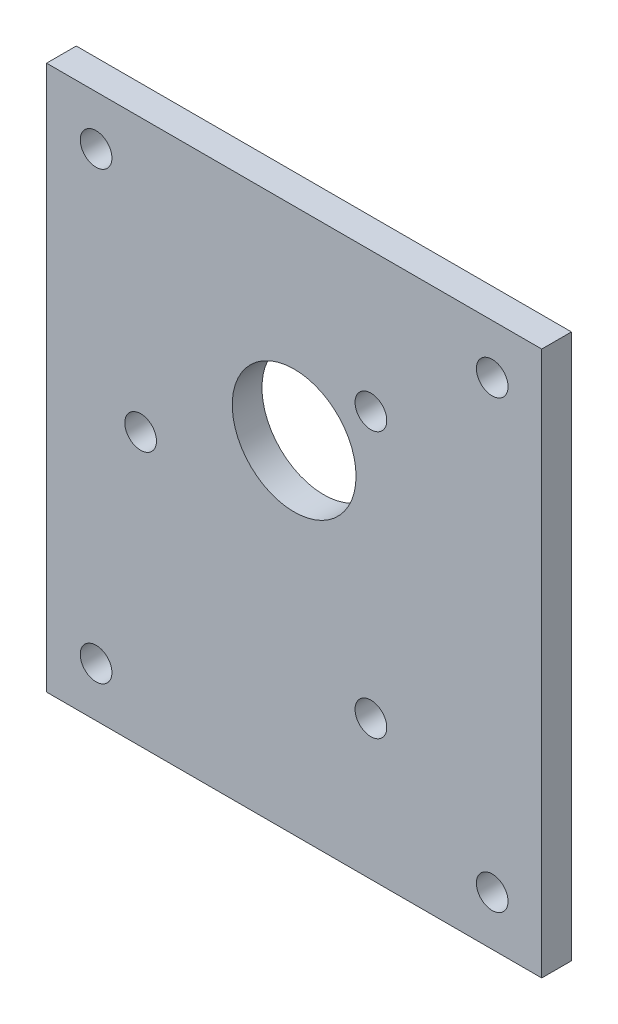
ISO-10303-21;
HEADER;
FILE_DESCRIPTION(('STEP AP214'),'2;1');
FILE_NAME('part.step','',(''),(''),'','','');
FILE_SCHEMA(('AUTOMOTIVE_DESIGN { 1 0 10303 214 1 1 1 1 }'));
ENDSEC;
DATA;
#1=APPLICATION_CONTEXT('core data for automotive mechanical design processes');
#2=APPLICATION_PROTOCOL_DEFINITION('international standard','automotive_design',2000,#1);
#3=PRODUCT_CONTEXT('',#1,'mechanical');
#4=PRODUCT('Part','Part','',(#3));
#5=PRODUCT_RELATED_PRODUCT_CATEGORY('part','',(#4));
#6=PRODUCT_DEFINITION_FORMATION('','',#4);
#7=PRODUCT_DEFINITION_CONTEXT('part definition',#1,'design');
#8=PRODUCT_DEFINITION('design','',#6,#7);
#9=PRODUCT_DEFINITION_SHAPE('','',#8);
#10=(LENGTH_UNIT() NAMED_UNIT(*) SI_UNIT(.MILLI.,.METRE.));
#11=(NAMED_UNIT(*) PLANE_ANGLE_UNIT() SI_UNIT($,.RADIAN.));
#12=(NAMED_UNIT(*) SI_UNIT($,.STERADIAN.) SOLID_ANGLE_UNIT());
#13=UNCERTAINTY_MEASURE_WITH_UNIT(LENGTH_MEASURE(1.E-05),#10,'distance_accuracy_value','');
#14=(GEOMETRIC_REPRESENTATION_CONTEXT(3) GLOBAL_UNCERTAINTY_ASSIGNED_CONTEXT((#13)) GLOBAL_UNIT_ASSIGNED_CONTEXT((#10,
#11,#12)) REPRESENTATION_CONTEXT('',''));
#15=CARTESIAN_POINT('',(0.,0.,0.));
#16=DIRECTION('',(0.,0.,1.));
#17=DIRECTION('',(1.,0.,0.));
#18=AXIS2_PLACEMENT_3D('',#15,#16,#17);
#19=CARTESIAN_POINT('',(0.,0.,3.));
#20=DIRECTION('',(0.,0.,1.));
#21=DIRECTION('',(1.,0.,0.));
#22=AXIS2_PLACEMENT_3D('',#19,#20,#21);
#23=PLANE('',#22);
#24=CARTESIAN_POINT('',(-20.,-22.5,3.));
#25=DIRECTION('',(0.,0.,1.));
#26=DIRECTION('',(1.,0.,0.));
#27=AXIS2_PLACEMENT_3D('',#24,#25,#26);
#28=CIRCLE('',#27,1.6);
#29=CARTESIAN_POINT('',(-18.4,-22.5,3.));
#30=VERTEX_POINT('',#29);
#31=EDGE_CURVE('E178',#30,#30,#28,.T.);
#32=ORIENTED_EDGE('',*,*,#31,.F.);
#33=EDGE_LOOP('',(#32));
#34=FACE_BOUND('',#33,.T.);
#35=CARTESIAN_POINT('',(-20.,22.5,3.));
#36=DIRECTION('',(0.,0.,1.));
#37=DIRECTION('',(1.,0.,0.));
#38=AXIS2_PLACEMENT_3D('',#35,#36,#37);
#39=CIRCLE('',#38,1.6);
#40=CARTESIAN_POINT('',(-18.4,22.5,3.));
#41=VERTEX_POINT('',#40);
#42=EDGE_CURVE('E162',#41,#41,#39,.T.);
#43=ORIENTED_EDGE('',*,*,#42,.F.);
#44=EDGE_LOOP('',(#43));
#45=FACE_BOUND('',#44,.T.);
#46=CARTESIAN_POINT('',(7.75000000000006,13.4233937586588,3.));
#47=DIRECTION('',(0.,0.,1.));
#48=DIRECTION('',(1.,0.,0.));
#49=AXIS2_PLACEMENT_3D('',#46,#47,#48);
#50=CIRCLE('',#49,1.6);
#51=CARTESIAN_POINT('',(9.35000000000006,13.4233937586588,3.));
#52=VERTEX_POINT('',#51);
#53=EDGE_CURVE('E146',#52,#52,#50,.T.);
#54=ORIENTED_EDGE('',*,*,#53,.F.);
#55=EDGE_LOOP('',(#54));
#56=FACE_BOUND('',#55,.T.);
#57=CARTESIAN_POINT('',(0.,7.,3.));
#58=DIRECTION('',(0.,0.,1.));
#59=DIRECTION('',(1.,0.,0.));
#60=AXIS2_PLACEMENT_3D('',#57,#58,#59);
#61=CIRCLE('',#60,6.25000000000001);
#62=CARTESIAN_POINT('',(6.25000000000001,7.,3.));
#63=VERTEX_POINT('',#62);
#64=EDGE_CURVE('E116',#63,#63,#61,.T.);
#65=ORIENTED_EDGE('',*,*,#64,.F.);
#66=EDGE_LOOP('',(#65));
#67=FACE_BOUND('',#66,.T.);
#68=DIRECTION('',(0.,1.,0.));
#69=VECTOR('',#68,1.);
#70=CARTESIAN_POINT('',(25.,27.5,3.));
#71=LINE('',#70,#69);
#72=CARTESIAN_POINT('',(25.,-27.5,3.));
#73=VERTEX_POINT('',#72);
#74=CARTESIAN_POINT('',(25.,27.5,3.));
#75=VERTEX_POINT('',#74);
#76=EDGE_CURVE('E96',#73,#75,#71,.T.);
#77=ORIENTED_EDGE('',*,*,#76,.T.);
#78=DIRECTION('',(-1.,0.,0.));
#79=VECTOR('',#78,1.);
#80=CARTESIAN_POINT('',(-25.,27.5,3.));
#81=LINE('',#80,#79);
#82=CARTESIAN_POINT('',(-25.,27.5,3.));
#83=VERTEX_POINT('',#82);
#84=EDGE_CURVE('E91',#75,#83,#81,.T.);
#85=ORIENTED_EDGE('',*,*,#84,.T.);
#86=DIRECTION('',(0.,-1.,0.));
#87=VECTOR('',#86,1.);
#88=CARTESIAN_POINT('',(-25.,27.5,3.));
#89=LINE('',#88,#87);
#90=CARTESIAN_POINT('',(-25.,-27.5,3.));
#91=VERTEX_POINT('',#90);
#92=EDGE_CURVE('E94',#83,#91,#89,.T.);
#93=ORIENTED_EDGE('',*,*,#92,.T.);
#94=DIRECTION('',(1.,0.,0.));
#95=VECTOR('',#94,1.);
#96=CARTESIAN_POINT('',(-25.,-27.5,3.));
#97=LINE('',#96,#95);
#98=EDGE_CURVE('E61',#91,#73,#97,.T.);
#99=ORIENTED_EDGE('',*,*,#98,.T.);
#100=EDGE_LOOP('',(#77,#85,#93,#99));
#101=FACE_BOUND('',#100,.T.);
#102=CARTESIAN_POINT('',(-15.5,0.,3.));
#103=DIRECTION('',(0.,0.,1.));
#104=DIRECTION('',(1.,0.,0.));
#105=AXIS2_PLACEMENT_3D('',#102,#103,#104);
#106=CIRCLE('',#105,1.6);
#107=CARTESIAN_POINT('',(-13.9,0.,3.));
#108=VERTEX_POINT('',#107);
#109=EDGE_CURVE('E138',#108,#108,#106,.T.);
#110=ORIENTED_EDGE('',*,*,#109,.F.);
#111=EDGE_LOOP('',(#110));
#112=FACE_BOUND('',#111,.T.);
#113=CARTESIAN_POINT('',(7.74999999999987,-13.4233937586589,3.));
#114=DIRECTION('',(0.,0.,1.));
#115=DIRECTION('',(1.,0.,0.));
#116=AXIS2_PLACEMENT_3D('',#113,#114,#115);
#117=CIRCLE('',#116,1.6);
#118=CARTESIAN_POINT('',(9.34999999999988,-13.4233937586589,3.));
#119=VERTEX_POINT('',#118);
#120=EDGE_CURVE('E154',#119,#119,#117,.T.);
#121=ORIENTED_EDGE('',*,*,#120,.F.);
#122=EDGE_LOOP('',(#121));
#123=FACE_BOUND('',#122,.T.);
#124=CARTESIAN_POINT('',(20.,22.5,3.));
#125=DIRECTION('',(0.,0.,1.));
#126=DIRECTION('',(1.,0.,0.));
#127=AXIS2_PLACEMENT_3D('',#124,#125,#126);
#128=CIRCLE('',#127,1.6);
#129=CARTESIAN_POINT('',(21.6,22.5,3.));
#130=VERTEX_POINT('',#129);
#131=EDGE_CURVE('E170',#130,#130,#128,.T.);
#132=ORIENTED_EDGE('',*,*,#131,.F.);
#133=EDGE_LOOP('',(#132));
#134=FACE_BOUND('',#133,.T.);
#135=CARTESIAN_POINT('',(20.,-22.5,3.));
#136=DIRECTION('',(0.,0.,1.));
#137=DIRECTION('',(1.,0.,0.));
#138=AXIS2_PLACEMENT_3D('',#135,#136,#137);
#139=CIRCLE('',#138,1.6);
#140=CARTESIAN_POINT('',(21.6,-22.5,3.));
#141=VERTEX_POINT('',#140);
#142=EDGE_CURVE('E186',#141,#141,#139,.T.);
#143=ORIENTED_EDGE('',*,*,#142,.F.);
#144=EDGE_LOOP('',(#143));
#145=FACE_BOUND('',#144,.T.);
#146=ADVANCED_FACE('F43',(#34,#45,#56,#67,#101,#112,#123,#134,#145),#23,.T.);
#147=CARTESIAN_POINT('',(0.,0.,0.));
#148=DIRECTION('',(0.,0.,1.));
#149=DIRECTION('',(1.,0.,0.));
#150=AXIS2_PLACEMENT_3D('',#147,#148,#149);
#151=PLANE('',#150);
#152=DIRECTION('',(0.,1.,0.));
#153=VECTOR('',#152,1.);
#154=CARTESIAN_POINT('',(25.,27.5,0.));
#155=LINE('',#154,#153);
#156=CARTESIAN_POINT('',(25.,-27.5,0.));
#157=VERTEX_POINT('',#156);
#158=CARTESIAN_POINT('',(25.,27.5,0.));
#159=VERTEX_POINT('',#158);
#160=EDGE_CURVE('E112',#157,#159,#155,.T.);
#161=ORIENTED_EDGE('',*,*,#160,.F.);
#162=DIRECTION('',(1.,0.,0.));
#163=VECTOR('',#162,1.);
#164=CARTESIAN_POINT('',(-25.,-27.5,0.));
#165=LINE('',#164,#163);
#166=CARTESIAN_POINT('',(-25.,-27.5,0.));
#167=VERTEX_POINT('',#166);
#168=EDGE_CURVE('E84',#167,#157,#165,.T.);
#169=ORIENTED_EDGE('',*,*,#168,.F.);
#170=DIRECTION('',(0.,-1.,0.));
#171=VECTOR('',#170,1.);
#172=CARTESIAN_POINT('',(-25.,27.5,0.));
#173=LINE('',#172,#171);
#174=CARTESIAN_POINT('',(-25.,27.5,0.));
#175=VERTEX_POINT('',#174);
#176=EDGE_CURVE('E78',#175,#167,#173,.T.);
#177=ORIENTED_EDGE('',*,*,#176,.F.);
#178=DIRECTION('',(-1.,0.,0.));
#179=VECTOR('',#178,1.);
#180=CARTESIAN_POINT('',(-25.,27.5,0.));
#181=LINE('',#180,#179);
#182=EDGE_CURVE('E101',#159,#175,#181,.T.);
#183=ORIENTED_EDGE('',*,*,#182,.F.);
#184=EDGE_LOOP('',(#161,#169,#177,#183));
#185=FACE_BOUND('',#184,.T.);
#186=CARTESIAN_POINT('',(0.,7.,0.));
#187=DIRECTION('',(0.,0.,1.));
#188=DIRECTION('',(1.,0.,0.));
#189=AXIS2_PLACEMENT_3D('',#186,#187,#188);
#190=CIRCLE('',#189,6.25000000000001);
#191=CARTESIAN_POINT('',(6.25000000000001,7.,0.));
#192=VERTEX_POINT('',#191);
#193=EDGE_CURVE('E134',#192,#192,#190,.T.);
#194=ORIENTED_EDGE('',*,*,#193,.T.);
#195=EDGE_LOOP('',(#194));
#196=FACE_BOUND('',#195,.T.);
#197=CARTESIAN_POINT('',(-15.5,0.,0.));
#198=DIRECTION('',(0.,0.,1.));
#199=DIRECTION('',(1.,0.,0.));
#200=AXIS2_PLACEMENT_3D('',#197,#198,#199);
#201=CIRCLE('',#200,1.6);
#202=CARTESIAN_POINT('',(-13.9,0.,0.));
#203=VERTEX_POINT('',#202);
#204=EDGE_CURVE('E142',#203,#203,#201,.T.);
#205=ORIENTED_EDGE('',*,*,#204,.T.);
#206=EDGE_LOOP('',(#205));
#207=FACE_BOUND('',#206,.T.);
#208=CARTESIAN_POINT('',(7.75000000000006,13.4233937586588,0.));
#209=DIRECTION('',(0.,0.,1.));
#210=DIRECTION('',(1.,0.,0.));
#211=AXIS2_PLACEMENT_3D('',#208,#209,#210);
#212=CIRCLE('',#211,1.6);
#213=CARTESIAN_POINT('',(9.35000000000006,13.4233937586588,0.));
#214=VERTEX_POINT('',#213);
#215=EDGE_CURVE('E150',#214,#214,#212,.T.);
#216=ORIENTED_EDGE('',*,*,#215,.T.);
#217=EDGE_LOOP('',(#216));
#218=FACE_BOUND('',#217,.T.);
#219=CARTESIAN_POINT('',(7.74999999999987,-13.4233937586589,0.));
#220=DIRECTION('',(0.,0.,1.));
#221=DIRECTION('',(1.,0.,0.));
#222=AXIS2_PLACEMENT_3D('',#219,#220,#221);
#223=CIRCLE('',#222,1.6);
#224=CARTESIAN_POINT('',(9.34999999999988,-13.4233937586589,0.));
#225=VERTEX_POINT('',#224);
#226=EDGE_CURVE('E158',#225,#225,#223,.T.);
#227=ORIENTED_EDGE('',*,*,#226,.T.);
#228=EDGE_LOOP('',(#227));
#229=FACE_BOUND('',#228,.T.);
#230=CARTESIAN_POINT('',(-20.,22.5,0.));
#231=DIRECTION('',(0.,0.,1.));
#232=DIRECTION('',(1.,0.,0.));
#233=AXIS2_PLACEMENT_3D('',#230,#231,#232);
#234=CIRCLE('',#233,1.6);
#235=CARTESIAN_POINT('',(-18.4,22.5,0.));
#236=VERTEX_POINT('',#235);
#237=EDGE_CURVE('E166',#236,#236,#234,.T.);
#238=ORIENTED_EDGE('',*,*,#237,.T.);
#239=EDGE_LOOP('',(#238));
#240=FACE_BOUND('',#239,.T.);
#241=CARTESIAN_POINT('',(20.,22.5,0.));
#242=DIRECTION('',(0.,0.,1.));
#243=DIRECTION('',(1.,0.,0.));
#244=AXIS2_PLACEMENT_3D('',#241,#242,#243);
#245=CIRCLE('',#244,1.6);
#246=CARTESIAN_POINT('',(21.6,22.5,0.));
#247=VERTEX_POINT('',#246);
#248=EDGE_CURVE('E174',#247,#247,#245,.T.);
#249=ORIENTED_EDGE('',*,*,#248,.T.);
#250=EDGE_LOOP('',(#249));
#251=FACE_BOUND('',#250,.T.);
#252=CARTESIAN_POINT('',(-20.,-22.5,0.));
#253=DIRECTION('',(0.,0.,1.));
#254=DIRECTION('',(1.,0.,0.));
#255=AXIS2_PLACEMENT_3D('',#252,#253,#254);
#256=CIRCLE('',#255,1.6);
#257=CARTESIAN_POINT('',(-18.4,-22.5,0.));
#258=VERTEX_POINT('',#257);
#259=EDGE_CURVE('E182',#258,#258,#256,.T.);
#260=ORIENTED_EDGE('',*,*,#259,.T.);
#261=EDGE_LOOP('',(#260));
#262=FACE_BOUND('',#261,.T.);
#263=CARTESIAN_POINT('',(20.,-22.5,0.));
#264=DIRECTION('',(0.,0.,1.));
#265=DIRECTION('',(1.,0.,0.));
#266=AXIS2_PLACEMENT_3D('',#263,#264,#265);
#267=CIRCLE('',#266,1.6);
#268=CARTESIAN_POINT('',(21.6,-22.5,0.));
#269=VERTEX_POINT('',#268);
#270=EDGE_CURVE('E190',#269,#269,#267,.T.);
#271=ORIENTED_EDGE('',*,*,#270,.T.);
#272=EDGE_LOOP('',(#271));
#273=FACE_BOUND('',#272,.T.);
#274=ADVANCED_FACE('F129',(#185,#196,#207,#218,#229,#240,#251,#262,#273),#151,.F.);
#275=CARTESIAN_POINT('',(25.,27.5,3.));
#276=DIRECTION('',(-1.,0.,0.));
#277=DIRECTION('',(0.,-1.,0.));
#278=AXIS2_PLACEMENT_3D('',#275,#276,#277);
#279=PLANE('',#278);
#280=ORIENTED_EDGE('',*,*,#160,.T.);
#281=DIRECTION('',(0.,0.,-1.));
#282=VECTOR('',#281,1.);
#283=CARTESIAN_POINT('',(25.,27.5,3.));
#284=LINE('',#283,#282);
#285=EDGE_CURVE('E11',#75,#159,#284,.T.);
#286=ORIENTED_EDGE('',*,*,#285,.F.);
#287=ORIENTED_EDGE('',*,*,#76,.F.);
#288=DIRECTION('',(0.,0.,-1.));
#289=VECTOR('',#288,1.);
#290=CARTESIAN_POINT('',(25.,-27.5,3.));
#291=LINE('',#290,#289);
#292=EDGE_CURVE('E108',#73,#157,#291,.T.);
#293=ORIENTED_EDGE('',*,*,#292,.T.);
#294=EDGE_LOOP('',(#280,#286,#287,#293));
#295=FACE_BOUND('',#294,.T.);
#296=ADVANCED_FACE('F45',(#295),#279,.F.);
#297=CARTESIAN_POINT('',(-25.,27.5,3.));
#298=DIRECTION('',(0.,-1.,0.));
#299=DIRECTION('',(0.,0.,-1.));
#300=AXIS2_PLACEMENT_3D('',#297,#298,#299);
#301=PLANE('',#300);
#302=ORIENTED_EDGE('',*,*,#182,.T.);
#303=DIRECTION('',(0.,0.,-1.));
#304=VECTOR('',#303,1.);
#305=CARTESIAN_POINT('',(-25.,27.5,3.));
#306=LINE('',#305,#304);
#307=EDGE_CURVE('E53',#83,#175,#306,.T.);
#308=ORIENTED_EDGE('',*,*,#307,.F.);
#309=ORIENTED_EDGE('',*,*,#84,.F.);
#310=ORIENTED_EDGE('',*,*,#285,.T.);
#311=EDGE_LOOP('',(#302,#308,#309,#310));
#312=FACE_BOUND('',#311,.T.);
#313=ADVANCED_FACE('F100',(#312),#301,.F.);
#314=CARTESIAN_POINT('',(-25.,27.5,3.));
#315=DIRECTION('',(1.,0.,0.));
#316=DIRECTION('',(0.,1.,0.));
#317=AXIS2_PLACEMENT_3D('',#314,#315,#316);
#318=PLANE('',#317);
#319=ORIENTED_EDGE('',*,*,#176,.T.);
#320=DIRECTION('',(0.,0.,-1.));
#321=VECTOR('',#320,1.);
#322=CARTESIAN_POINT('',(-25.,-27.5,3.));
#323=LINE('',#322,#321);
#324=EDGE_CURVE('E103',#91,#167,#323,.T.);
#325=ORIENTED_EDGE('',*,*,#324,.F.);
#326=ORIENTED_EDGE('',*,*,#92,.F.);
#327=ORIENTED_EDGE('',*,*,#307,.T.);
#328=EDGE_LOOP('',(#319,#325,#326,#327));
#329=FACE_BOUND('',#328,.T.);
#330=ADVANCED_FACE('F104',(#329),#318,.F.);
#331=CARTESIAN_POINT('',(-25.,-27.5,3.));
#332=DIRECTION('',(0.,1.,0.));
#333=DIRECTION('',(0.,0.,1.));
#334=AXIS2_PLACEMENT_3D('',#331,#332,#333);
#335=PLANE('',#334);
#336=ORIENTED_EDGE('',*,*,#168,.T.);
#337=ORIENTED_EDGE('',*,*,#292,.F.);
#338=ORIENTED_EDGE('',*,*,#98,.F.);
#339=ORIENTED_EDGE('',*,*,#324,.T.);
#340=EDGE_LOOP('',(#336,#337,#338,#339));
#341=FACE_BOUND('',#340,.T.);
#342=ADVANCED_FACE('F126',(#341),#335,.F.);
#343=CARTESIAN_POINT('',(0.,7.,3.));
#344=DIRECTION('',(0.,0.,-1.));
#345=DIRECTION('',(-1.,0.,0.));
#346=AXIS2_PLACEMENT_3D('',#343,#344,#345);
#347=CYLINDRICAL_SURFACE('',#346,6.25000000000001);
#348=ORIENTED_EDGE('',*,*,#64,.T.);
#349=EDGE_LOOP('',(#348));
#350=FACE_BOUND('',#349,.T.);
#351=ORIENTED_EDGE('',*,*,#193,.F.);
#352=EDGE_LOOP('',(#351));
#353=FACE_BOUND('',#352,.T.);
#354=ADVANCED_FACE('F211',(#350,#353),#347,.F.);
#355=CARTESIAN_POINT('',(-15.5,0.,3.));
#356=DIRECTION('',(0.,0.,-1.));
#357=DIRECTION('',(-1.,0.,0.));
#358=AXIS2_PLACEMENT_3D('',#355,#356,#357);
#359=CYLINDRICAL_SURFACE('',#358,1.6);
#360=ORIENTED_EDGE('',*,*,#109,.T.);
#361=EDGE_LOOP('',(#360));
#362=FACE_BOUND('',#361,.T.);
#363=ORIENTED_EDGE('',*,*,#204,.F.);
#364=EDGE_LOOP('',(#363));
#365=FACE_BOUND('',#364,.T.);
#366=ADVANCED_FACE('F265',(#362,#365),#359,.F.);
#367=CARTESIAN_POINT('',(7.75000000000006,13.4233937586588,3.));
#368=DIRECTION('',(0.,0.,-1.));
#369=DIRECTION('',(-1.,0.,0.));
#370=AXIS2_PLACEMENT_3D('',#367,#368,#369);
#371=CYLINDRICAL_SURFACE('',#370,1.6);
#372=ORIENTED_EDGE('',*,*,#53,.T.);
#373=EDGE_LOOP('',(#372));
#374=FACE_BOUND('',#373,.T.);
#375=ORIENTED_EDGE('',*,*,#215,.F.);
#376=EDGE_LOOP('',(#375));
#377=FACE_BOUND('',#376,.T.);
#378=ADVANCED_FACE('F274',(#374,#377),#371,.F.);
#379=CARTESIAN_POINT('',(7.74999999999987,-13.4233937586589,3.));
#380=DIRECTION('',(0.,0.,-1.));
#381=DIRECTION('',(-1.,0.,0.));
#382=AXIS2_PLACEMENT_3D('',#379,#380,#381);
#383=CYLINDRICAL_SURFACE('',#382,1.6);
#384=ORIENTED_EDGE('',*,*,#120,.T.);
#385=EDGE_LOOP('',(#384));
#386=FACE_BOUND('',#385,.T.);
#387=ORIENTED_EDGE('',*,*,#226,.F.);
#388=EDGE_LOOP('',(#387));
#389=FACE_BOUND('',#388,.T.);
#390=ADVANCED_FACE('F283',(#386,#389),#383,.F.);
#391=CARTESIAN_POINT('',(-20.,22.5,3.));
#392=DIRECTION('',(0.,0.,-1.));
#393=DIRECTION('',(-1.,0.,0.));
#394=AXIS2_PLACEMENT_3D('',#391,#392,#393);
#395=CYLINDRICAL_SURFACE('',#394,1.6);
#396=ORIENTED_EDGE('',*,*,#42,.T.);
#397=EDGE_LOOP('',(#396));
#398=FACE_BOUND('',#397,.T.);
#399=ORIENTED_EDGE('',*,*,#237,.F.);
#400=EDGE_LOOP('',(#399));
#401=FACE_BOUND('',#400,.T.);
#402=ADVANCED_FACE('F293',(#398,#401),#395,.F.);
#403=CARTESIAN_POINT('',(20.,22.5,3.));
#404=DIRECTION('',(0.,0.,-1.));
#405=DIRECTION('',(-1.,0.,0.));
#406=AXIS2_PLACEMENT_3D('',#403,#404,#405);
#407=CYLINDRICAL_SURFACE('',#406,1.6);
#408=ORIENTED_EDGE('',*,*,#131,.T.);
#409=EDGE_LOOP('',(#408));
#410=FACE_BOUND('',#409,.T.);
#411=ORIENTED_EDGE('',*,*,#248,.F.);
#412=EDGE_LOOP('',(#411));
#413=FACE_BOUND('',#412,.T.);
#414=ADVANCED_FACE('F303',(#410,#413),#407,.F.);
#415=CARTESIAN_POINT('',(-20.,-22.5,3.));
#416=DIRECTION('',(0.,0.,-1.));
#417=DIRECTION('',(-1.,0.,0.));
#418=AXIS2_PLACEMENT_3D('',#415,#416,#417);
#419=CYLINDRICAL_SURFACE('',#418,1.6);
#420=ORIENTED_EDGE('',*,*,#31,.T.);
#421=EDGE_LOOP('',(#420));
#422=FACE_BOUND('',#421,.T.);
#423=ORIENTED_EDGE('',*,*,#259,.F.);
#424=EDGE_LOOP('',(#423));
#425=FACE_BOUND('',#424,.T.);
#426=ADVANCED_FACE('F313',(#422,#425),#419,.F.);
#427=CARTESIAN_POINT('',(20.,-22.5,3.));
#428=DIRECTION('',(0.,0.,-1.));
#429=DIRECTION('',(-1.,0.,0.));
#430=AXIS2_PLACEMENT_3D('',#427,#428,#429);
#431=CYLINDRICAL_SURFACE('',#430,1.6);
#432=ORIENTED_EDGE('',*,*,#142,.T.);
#433=EDGE_LOOP('',(#432));
#434=FACE_BOUND('',#433,.T.);
#435=ORIENTED_EDGE('',*,*,#270,.F.);
#436=EDGE_LOOP('',(#435));
#437=FACE_BOUND('',#436,.T.);
#438=ADVANCED_FACE('F198',(#434,#437),#431,.F.);
#439=CLOSED_SHELL('',(#146,#274,#296,#313,#330,#342,#354,#366,#378,#390,#402,#414,#426,#438));
#440=MANIFOLD_SOLID_BREP('B2',#439);
#441=ADVANCED_BREP_SHAPE_REPRESENTATION('',(#18,#440),#14);
#442=SHAPE_DEFINITION_REPRESENTATION(#9,#441);
ENDSEC;
END-ISO-10303-21;
